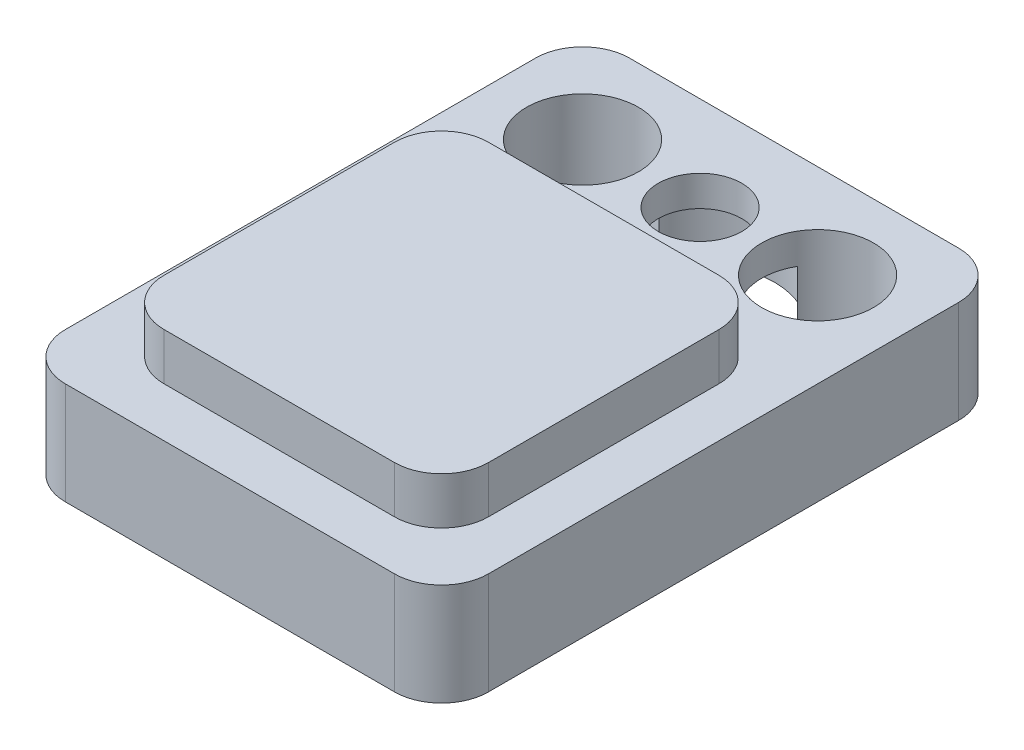
ISO-10303-21;
HEADER;
FILE_DESCRIPTION(('STEP AP214'),'2;1');
FILE_NAME('part.step','',(''),(''),'','','');
FILE_SCHEMA(('AUTOMOTIVE_DESIGN { 1 0 10303 214 1 1 1 1 }'));
ENDSEC;
DATA;
#1=APPLICATION_CONTEXT('core data for automotive mechanical design processes');
#2=APPLICATION_PROTOCOL_DEFINITION('international standard','automotive_design',2000,#1);
#3=PRODUCT_CONTEXT('',#1,'mechanical');
#4=PRODUCT('Part','Part','',(#3));
#5=PRODUCT_RELATED_PRODUCT_CATEGORY('part','',(#4));
#6=PRODUCT_DEFINITION_FORMATION('','',#4);
#7=PRODUCT_DEFINITION_CONTEXT('part definition',#1,'design');
#8=PRODUCT_DEFINITION('design','',#6,#7);
#9=PRODUCT_DEFINITION_SHAPE('','',#8);
#10=(LENGTH_UNIT() NAMED_UNIT(*) SI_UNIT(.MILLI.,.METRE.));
#11=(NAMED_UNIT(*) PLANE_ANGLE_UNIT() SI_UNIT($,.RADIAN.));
#12=(NAMED_UNIT(*) SI_UNIT($,.STERADIAN.) SOLID_ANGLE_UNIT());
#13=UNCERTAINTY_MEASURE_WITH_UNIT(LENGTH_MEASURE(1.E-05),#10,'distance_accuracy_value','');
#14=(GEOMETRIC_REPRESENTATION_CONTEXT(3) GLOBAL_UNCERTAINTY_ASSIGNED_CONTEXT((#13)) GLOBAL_UNIT_ASSIGNED_CONTEXT((#10,
#11,#12)) REPRESENTATION_CONTEXT('',''));
#15=CARTESIAN_POINT('',(0.,0.,0.));
#16=DIRECTION('',(0.,0.,1.));
#17=DIRECTION('',(1.,0.,0.));
#18=AXIS2_PLACEMENT_3D('',#15,#16,#17);
#19=CARTESIAN_POINT('',(0.,0.,-4.));
#20=DIRECTION('',(0.,-1.,0.));
#21=DIRECTION('',(0.,0.,-1.));
#22=AXIS2_PLACEMENT_3D('',#19,#20,#21);
#23=CYLINDRICAL_SURFACE('',#22,1.5875);
#24=CARTESIAN_POINT('',(0.,1.524,-4.));
#25=DIRECTION('',(0.,-1.,0.));
#26=DIRECTION('',(0.,0.,-1.));
#27=AXIS2_PLACEMENT_3D('',#24,#25,#26);
#28=CIRCLE('',#27,1.5875);
#29=CARTESIAN_POINT('',(-1.470513671875,1.524,-4.59811854245518));
#30=VERTEX_POINT('',#29);
#31=CARTESIAN_POINT('',(1.470513671875,1.524,-4.59811854245517));
#32=VERTEX_POINT('',#31);
#33=EDGE_CURVE('E186',#30,#32,#28,.T.);
#34=ORIENTED_EDGE('',*,*,#33,.F.);
#35=DIRECTION('',(0.,-1.,0.));
#36=VECTOR('',#35,1.);
#37=CARTESIAN_POINT('',(-1.470513671875,5.,-4.59811854245518));
#38=LINE('',#37,#36);
#39=CARTESIAN_POINT('',(-1.470513671875,0.,-4.59811854245518));
#40=VERTEX_POINT('',#39);
#41=EDGE_CURVE('E171',#30,#40,#38,.T.);
#42=ORIENTED_EDGE('',*,*,#41,.T.);
#43=CARTESIAN_POINT('',(0.,0.,-4.));
#44=DIRECTION('',(0.,-1.,0.));
#45=DIRECTION('',(0.,0.,-1.));
#46=AXIS2_PLACEMENT_3D('',#43,#44,#45);
#47=CIRCLE('',#46,1.5875);
#48=CARTESIAN_POINT('',(1.470513671875,0.,-4.59811854245517));
#49=VERTEX_POINT('',#48);
#50=EDGE_CURVE('E184',#40,#49,#47,.T.);
#51=ORIENTED_EDGE('',*,*,#50,.T.);
#52=DIRECTION('',(0.,-1.,0.));
#53=VECTOR('',#52,1.);
#54=CARTESIAN_POINT('',(1.470513671875,5.,-4.59811854245517));
#55=LINE('',#54,#53);
#56=EDGE_CURVE('E243',#49,#32,#55,.F.);
#57=ORIENTED_EDGE('',*,*,#56,.T.);
#58=EDGE_LOOP('',(#34,#42,#51,#57));
#59=FACE_BOUND('',#58,.T.);
#60=ADVANCED_FACE('F31',(#59),#23,.F.);
#61=CARTESIAN_POINT('',(-4.5,2.175,-6.));
#62=DIRECTION('',(0.,1.,0.));
#63=DIRECTION('',(0.,0.,1.));
#64=AXIS2_PLACEMENT_3D('',#61,#62,#63);
#65=PLANE('',#64);
#66=CARTESIAN_POINT('',(-2.5,2.175,-4.));
#67=DIRECTION('',(0.,1.,0.));
#68=DIRECTION('',(0.,0.,1.));
#69=AXIS2_PLACEMENT_3D('',#66,#67,#68);
#70=CIRCLE('',#69,1.190625);
#71=CARTESIAN_POINT('',(-2.5,2.175,-2.809375));
#72=VERTEX_POINT('',#71);
#73=EDGE_CURVE('E398',#72,#72,#70,.T.);
#74=ORIENTED_EDGE('',*,*,#73,.F.);
#75=EDGE_LOOP('',(#74));
#76=FACE_BOUND('',#75,.T.);
#77=CARTESIAN_POINT('',(2.5,2.175,-4.));
#78=DIRECTION('',(0.,1.,0.));
#79=DIRECTION('',(0.,0.,1.));
#80=AXIS2_PLACEMENT_3D('',#77,#78,#79);
#81=CIRCLE('',#80,1.190625);
#82=CARTESIAN_POINT('',(2.5,2.175,-2.809375));
#83=VERTEX_POINT('',#82);
#84=EDGE_CURVE('E194',#83,#83,#81,.T.);
#85=ORIENTED_EDGE('',*,*,#84,.F.);
#86=EDGE_LOOP('',(#85));
#87=FACE_BOUND('',#86,.T.);
#88=CARTESIAN_POINT('',(0.,2.175,-4.));
#89=DIRECTION('',(0.,1.,0.));
#90=DIRECTION('',(0.,0.,1.));
#91=AXIS2_PLACEMENT_3D('',#88,#89,#90);
#92=CIRCLE('',#91,0.888999999999999);
#93=CARTESIAN_POINT('',(0.,2.175,-3.111));
#94=VERTEX_POINT('',#93);
#95=EDGE_CURVE('E207',#94,#94,#92,.T.);
#96=ORIENTED_EDGE('',*,*,#95,.F.);
#97=EDGE_LOOP('',(#96));
#98=FACE_BOUND('',#97,.T.);
#99=DIRECTION('',(0.,0.,1.));
#100=VECTOR('',#99,1.);
#101=CARTESIAN_POINT('',(-4.5,2.175,6.));
#102=LINE('',#101,#100);
#103=CARTESIAN_POINT('',(-4.5,2.175,-5.));
#104=VERTEX_POINT('',#103);
#105=CARTESIAN_POINT('',(-4.5,2.175,5.));
#106=VERTEX_POINT('',#105);
#107=EDGE_CURVE('E230',#104,#106,#102,.T.);
#108=ORIENTED_EDGE('',*,*,#107,.T.);
#109=CARTESIAN_POINT('',(-3.5,2.175,5.));
#110=DIRECTION('',(0.,1.,0.));
#111=DIRECTION('',(0.,0.,1.));
#112=AXIS2_PLACEMENT_3D('',#109,#110,#111);
#113=CIRCLE('',#112,1.);
#114=CARTESIAN_POINT('',(-3.5,2.175,6.));
#115=VERTEX_POINT('',#114);
#116=EDGE_CURVE('E284',#106,#115,#113,.T.);
#117=ORIENTED_EDGE('',*,*,#116,.T.);
#118=DIRECTION('',(1.,0.,0.));
#119=VECTOR('',#118,1.);
#120=CARTESIAN_POINT('',(4.5,2.175,6.));
#121=LINE('',#120,#119);
#122=CARTESIAN_POINT('',(3.5,2.175,6.));
#123=VERTEX_POINT('',#122);
#124=EDGE_CURVE('E233',#115,#123,#121,.T.);
#125=ORIENTED_EDGE('',*,*,#124,.T.);
#126=CARTESIAN_POINT('',(3.5,2.175,5.));
#127=DIRECTION('',(0.,1.,0.));
#128=DIRECTION('',(0.,0.,1.));
#129=AXIS2_PLACEMENT_3D('',#126,#127,#128);
#130=CIRCLE('',#129,1.);
#131=CARTESIAN_POINT('',(4.5,2.175,5.));
#132=VERTEX_POINT('',#131);
#133=EDGE_CURVE('E280',#123,#132,#130,.T.);
#134=ORIENTED_EDGE('',*,*,#133,.T.);
#135=DIRECTION('',(0.,0.,-1.));
#136=VECTOR('',#135,1.);
#137=CARTESIAN_POINT('',(4.5,2.175,6.));
#138=LINE('',#137,#136);
#139=CARTESIAN_POINT('',(4.5,2.175,-5.));
#140=VERTEX_POINT('',#139);
#141=EDGE_CURVE('E237',#132,#140,#138,.T.);
#142=ORIENTED_EDGE('',*,*,#141,.T.);
#143=CARTESIAN_POINT('',(3.5,2.175,-5.));
#144=DIRECTION('',(0.,1.,0.));
#145=DIRECTION('',(0.,0.,1.));
#146=AXIS2_PLACEMENT_3D('',#143,#144,#145);
#147=CIRCLE('',#146,1.);
#148=CARTESIAN_POINT('',(3.5,2.175,-6.));
#149=VERTEX_POINT('',#148);
#150=EDGE_CURVE('E278',#140,#149,#147,.T.);
#151=ORIENTED_EDGE('',*,*,#150,.T.);
#152=DIRECTION('',(-1.,0.,0.));
#153=VECTOR('',#152,1.);
#154=CARTESIAN_POINT('',(4.5,2.175,-6.));
#155=LINE('',#154,#153);
#156=CARTESIAN_POINT('',(-3.5,2.175,-6.));
#157=VERTEX_POINT('',#156);
#158=EDGE_CURVE('E240',#149,#157,#155,.T.);
#159=ORIENTED_EDGE('',*,*,#158,.T.);
#160=CARTESIAN_POINT('',(-3.5,2.175,-5.));
#161=DIRECTION('',(0.,1.,0.));
#162=DIRECTION('',(0.,0.,1.));
#163=AXIS2_PLACEMENT_3D('',#160,#161,#162);
#164=CIRCLE('',#163,1.);
#165=EDGE_CURVE('E282',#157,#104,#164,.T.);
#166=ORIENTED_EDGE('',*,*,#165,.T.);
#167=EDGE_LOOP('',(#108,#117,#125,#134,#142,#151,#159,#166));
#168=FACE_BOUND('',#167,.T.);
#169=DIRECTION('',(1.,0.,0.));
#170=VECTOR('',#169,1.);
#171=CARTESIAN_POINT('',(-3.45,2.175,4.95));
#172=LINE('',#171,#170);
#173=CARTESIAN_POINT('',(-2.45,2.175,4.95));
#174=VERTEX_POINT('',#173);
#175=CARTESIAN_POINT('',(2.45,2.175,4.95));
#176=VERTEX_POINT('',#175);
#177=EDGE_CURVE('E223',#174,#176,#172,.T.);
#178=ORIENTED_EDGE('',*,*,#177,.F.);
#179=CARTESIAN_POINT('',(-2.45,2.175,3.95));
#180=DIRECTION('',(0.,1.,0.));
#181=DIRECTION('',(0.,0.,1.));
#182=AXIS2_PLACEMENT_3D('',#179,#180,#181);
#183=CIRCLE('',#182,1.);
#184=CARTESIAN_POINT('',(-3.45,2.175,3.95));
#185=VERTEX_POINT('',#184);
#186=EDGE_CURVE('E322',#174,#185,#183,.F.);
#187=ORIENTED_EDGE('',*,*,#186,.T.);
#188=DIRECTION('',(0.,0.,1.));
#189=VECTOR('',#188,1.);
#190=CARTESIAN_POINT('',(-3.45,2.175,4.95));
#191=LINE('',#190,#189);
#192=CARTESIAN_POINT('',(-3.45,2.175,-0.95));
#193=VERTEX_POINT('',#192);
#194=EDGE_CURVE('E220',#193,#185,#191,.T.);
#195=ORIENTED_EDGE('',*,*,#194,.F.);
#196=CARTESIAN_POINT('',(-2.45,2.175,-0.950000000000001));
#197=DIRECTION('',(0.,1.,0.));
#198=DIRECTION('',(0.,0.,1.));
#199=AXIS2_PLACEMENT_3D('',#196,#197,#198);
#200=CIRCLE('',#199,1.);
#201=CARTESIAN_POINT('',(-2.45,2.175,-1.95));
#202=VERTEX_POINT('',#201);
#203=EDGE_CURVE('E324',#193,#202,#200,.F.);
#204=ORIENTED_EDGE('',*,*,#203,.T.);
#205=DIRECTION('',(-1.,0.,0.));
#206=VECTOR('',#205,1.);
#207=CARTESIAN_POINT('',(-3.45,2.175,-1.95));
#208=LINE('',#207,#206);
#209=CARTESIAN_POINT('',(2.45,2.175,-1.95));
#210=VERTEX_POINT('',#209);
#211=EDGE_CURVE('E212',#210,#202,#208,.T.);
#212=ORIENTED_EDGE('',*,*,#211,.F.);
#213=CARTESIAN_POINT('',(2.45,2.175,-0.950000000000001));
#214=DIRECTION('',(0.,1.,0.));
#215=DIRECTION('',(0.,0.,1.));
#216=AXIS2_PLACEMENT_3D('',#213,#214,#215);
#217=CIRCLE('',#216,1.);
#218=CARTESIAN_POINT('',(3.45,2.175,-0.95));
#219=VERTEX_POINT('',#218);
#220=EDGE_CURVE('E11',#210,#219,#217,.F.);
#221=ORIENTED_EDGE('',*,*,#220,.T.);
#222=DIRECTION('',(0.,0.,-1.));
#223=VECTOR('',#222,1.);
#224=CARTESIAN_POINT('',(3.45,2.175,4.95));
#225=LINE('',#224,#223);
#226=CARTESIAN_POINT('',(3.45,2.175,3.95));
#227=VERTEX_POINT('',#226);
#228=EDGE_CURVE('E226',#227,#219,#225,.T.);
#229=ORIENTED_EDGE('',*,*,#228,.F.);
#230=CARTESIAN_POINT('',(2.45,2.175,3.95));
#231=DIRECTION('',(0.,1.,0.));
#232=DIRECTION('',(0.,0.,1.));
#233=AXIS2_PLACEMENT_3D('',#230,#231,#232);
#234=CIRCLE('',#233,1.);
#235=EDGE_CURVE('E39',#227,#176,#234,.F.);
#236=ORIENTED_EDGE('',*,*,#235,.T.);
#237=EDGE_LOOP('',(#178,#187,#195,#204,#212,#221,#229,#236));
#238=FACE_BOUND('',#237,.T.);
#239=ADVANCED_FACE('F328',(#76,#87,#98,#168,#238),#65,.T.);
#240=CARTESIAN_POINT('',(-4.5,2.175,6.));
#241=DIRECTION('',(1.,0.,0.));
#242=DIRECTION('',(0.,0.,-1.));
#243=AXIS2_PLACEMENT_3D('',#240,#241,#242);
#244=PLANE('',#243);
#245=DIRECTION('',(0.,0.,1.));
#246=VECTOR('',#245,1.);
#247=CARTESIAN_POINT('',(-4.5,0.,6.));
#248=LINE('',#247,#246);
#249=CARTESIAN_POINT('',(-4.5,0.,-5.));
#250=VERTEX_POINT('',#249);
#251=CARTESIAN_POINT('',(-4.5,0.,5.));
#252=VERTEX_POINT('',#251);
#253=EDGE_CURVE('E219',#250,#252,#248,.T.);
#254=ORIENTED_EDGE('',*,*,#253,.T.);
#255=DIRECTION('',(0.,-1.,0.));
#256=VECTOR('',#255,1.);
#257=CARTESIAN_POINT('',(-4.5,2.175,5.));
#258=LINE('',#257,#256);
#259=EDGE_CURVE('E276',#252,#106,#258,.F.);
#260=ORIENTED_EDGE('',*,*,#259,.T.);
#261=ORIENTED_EDGE('',*,*,#107,.F.);
#262=DIRECTION('',(0.,-1.,0.));
#263=VECTOR('',#262,1.);
#264=CARTESIAN_POINT('',(-4.5,2.175,-5.));
#265=LINE('',#264,#263);
#266=EDGE_CURVE('E273',#104,#250,#265,.T.);
#267=ORIENTED_EDGE('',*,*,#266,.T.);
#268=EDGE_LOOP('',(#254,#260,#261,#267));
#269=FACE_BOUND('',#268,.T.);
#270=ADVANCED_FACE('F377',(#269),#244,.F.);
#271=CARTESIAN_POINT('',(4.5,2.175,6.));
#272=DIRECTION('',(0.,0.,-1.));
#273=DIRECTION('',(-1.,0.,0.));
#274=AXIS2_PLACEMENT_3D('',#271,#272,#273);
#275=PLANE('',#274);
#276=ORIENTED_EDGE('',*,*,#124,.F.);
#277=DIRECTION('',(0.,-1.,0.));
#278=VECTOR('',#277,1.);
#279=CARTESIAN_POINT('',(-3.5,2.175,6.));
#280=LINE('',#279,#278);
#281=CARTESIAN_POINT('',(-3.5,0.,6.));
#282=VERTEX_POINT('',#281);
#283=EDGE_CURVE('E262',#115,#282,#280,.T.);
#284=ORIENTED_EDGE('',*,*,#283,.T.);
#285=DIRECTION('',(1.,0.,0.));
#286=VECTOR('',#285,1.);
#287=CARTESIAN_POINT('',(4.5,0.,6.));
#288=LINE('',#287,#286);
#289=CARTESIAN_POINT('',(3.5,0.,6.));
#290=VERTEX_POINT('',#289);
#291=EDGE_CURVE('E246',#282,#290,#288,.T.);
#292=ORIENTED_EDGE('',*,*,#291,.T.);
#293=DIRECTION('',(0.,-1.,0.));
#294=VECTOR('',#293,1.);
#295=CARTESIAN_POINT('',(3.5,2.175,6.));
#296=LINE('',#295,#294);
#297=EDGE_CURVE('E187',#290,#123,#296,.F.);
#298=ORIENTED_EDGE('',*,*,#297,.T.);
#299=EDGE_LOOP('',(#276,#284,#292,#298));
#300=FACE_BOUND('',#299,.T.);
#301=ADVANCED_FACE('F420',(#300),#275,.F.);
#302=CARTESIAN_POINT('',(4.5,2.175,6.));
#303=DIRECTION('',(-1.,0.,0.));
#304=DIRECTION('',(0.,0.,1.));
#305=AXIS2_PLACEMENT_3D('',#302,#303,#304);
#306=PLANE('',#305);
#307=ORIENTED_EDGE('',*,*,#141,.F.);
#308=DIRECTION('',(0.,-1.,0.));
#309=VECTOR('',#308,1.);
#310=CARTESIAN_POINT('',(4.5,2.175,5.));
#311=LINE('',#310,#309);
#312=CARTESIAN_POINT('',(4.5,0.,5.));
#313=VERTEX_POINT('',#312);
#314=EDGE_CURVE('E314',#132,#313,#311,.T.);
#315=ORIENTED_EDGE('',*,*,#314,.T.);
#316=DIRECTION('',(0.,0.,-1.));
#317=VECTOR('',#316,1.);
#318=CARTESIAN_POINT('',(4.5,0.,6.));
#319=LINE('',#318,#317);
#320=CARTESIAN_POINT('',(4.5,0.,-5.));
#321=VERTEX_POINT('',#320);
#322=EDGE_CURVE('E249',#313,#321,#319,.T.);
#323=ORIENTED_EDGE('',*,*,#322,.T.);
#324=DIRECTION('',(0.,-1.,0.));
#325=VECTOR('',#324,1.);
#326=CARTESIAN_POINT('',(4.5,2.175,-5.));
#327=LINE('',#326,#325);
#328=EDGE_CURVE('E312',#321,#140,#327,.F.);
#329=ORIENTED_EDGE('',*,*,#328,.T.);
#330=EDGE_LOOP('',(#307,#315,#323,#329));
#331=FACE_BOUND('',#330,.T.);
#332=ADVANCED_FACE('F430',(#331),#306,.F.);
#333=CARTESIAN_POINT('',(4.5,2.175,-6.));
#334=DIRECTION('',(0.,0.,1.));
#335=DIRECTION('',(1.,0.,0.));
#336=AXIS2_PLACEMENT_3D('',#333,#334,#335);
#337=PLANE('',#336);
#338=DIRECTION('',(-1.,0.,0.));
#339=VECTOR('',#338,1.);
#340=CARTESIAN_POINT('',(4.5,0.,-6.));
#341=LINE('',#340,#339);
#342=CARTESIAN_POINT('',(3.5,0.,-6.));
#343=VERTEX_POINT('',#342);
#344=CARTESIAN_POINT('',(-3.5,0.,-6.));
#345=VERTEX_POINT('',#344);
#346=EDGE_CURVE('E234',#343,#345,#341,.T.);
#347=ORIENTED_EDGE('',*,*,#346,.T.);
#348=DIRECTION('',(0.,-1.,0.));
#349=VECTOR('',#348,1.);
#350=CARTESIAN_POINT('',(-3.5,2.175,-6.));
#351=LINE('',#350,#349);
#352=EDGE_CURVE('E310',#345,#157,#351,.F.);
#353=ORIENTED_EDGE('',*,*,#352,.T.);
#354=ORIENTED_EDGE('',*,*,#158,.F.);
#355=DIRECTION('',(0.,-1.,0.));
#356=VECTOR('',#355,1.);
#357=CARTESIAN_POINT('',(3.5,2.175,-6.));
#358=LINE('',#357,#356);
#359=EDGE_CURVE('E307',#149,#343,#358,.T.);
#360=ORIENTED_EDGE('',*,*,#359,.T.);
#361=EDGE_LOOP('',(#347,#353,#354,#360));
#362=FACE_BOUND('',#361,.T.);
#363=ADVANCED_FACE('F438',(#362),#337,.F.);
#364=CARTESIAN_POINT('',(-4.5,0.,-6.));
#365=DIRECTION('',(0.,1.,0.));
#366=DIRECTION('',(0.,0.,1.));
#367=AXIS2_PLACEMENT_3D('',#364,#365,#366);
#368=PLANE('',#367);
#369=ORIENTED_EDGE('',*,*,#50,.F.);
#370=CARTESIAN_POINT('',(-2.5,0.,-4.));
#371=DIRECTION('',(0.,-1.,0.));
#372=DIRECTION('',(0.,0.,-1.));
#373=AXIS2_PLACEMENT_3D('',#370,#371,#372);
#374=CIRCLE('',#373,1.190625);
#375=CARTESIAN_POINT('',(-1.470513671875,0.,-3.40188145754483));
#376=VERTEX_POINT('',#375);
#377=EDGE_CURVE('E168',#376,#40,#374,.T.);
#378=ORIENTED_EDGE('',*,*,#377,.F.);
#379=CARTESIAN_POINT('',(1.470513671875,0.,-3.40188145754483));
#380=VERTEX_POINT('',#379);
#381=EDGE_CURVE('E193',#380,#376,#47,.T.);
#382=ORIENTED_EDGE('',*,*,#381,.F.);
#383=CARTESIAN_POINT('',(2.5,0.,-4.));
#384=DIRECTION('',(0.,-1.,0.));
#385=DIRECTION('',(0.,0.,-1.));
#386=AXIS2_PLACEMENT_3D('',#383,#384,#385);
#387=CIRCLE('',#386,1.190625);
#388=EDGE_CURVE('E192',#49,#380,#387,.T.);
#389=ORIENTED_EDGE('',*,*,#388,.F.);
#390=EDGE_LOOP('',(#369,#378,#382,#389));
#391=FACE_BOUND('',#390,.T.);
#392=ORIENTED_EDGE('',*,*,#291,.F.);
#393=CARTESIAN_POINT('',(-3.5,0.,5.));
#394=DIRECTION('',(0.,1.,0.));
#395=DIRECTION('',(0.,0.,1.));
#396=AXIS2_PLACEMENT_3D('',#393,#394,#395);
#397=CIRCLE('',#396,1.);
#398=EDGE_CURVE('E271',#282,#252,#397,.F.);
#399=ORIENTED_EDGE('',*,*,#398,.T.);
#400=ORIENTED_EDGE('',*,*,#253,.F.);
#401=CARTESIAN_POINT('',(-3.5,0.,-5.));
#402=DIRECTION('',(0.,1.,0.));
#403=DIRECTION('',(0.,0.,1.));
#404=AXIS2_PLACEMENT_3D('',#401,#402,#403);
#405=CIRCLE('',#404,1.);
#406=EDGE_CURVE('E269',#250,#345,#405,.F.);
#407=ORIENTED_EDGE('',*,*,#406,.T.);
#408=ORIENTED_EDGE('',*,*,#346,.F.);
#409=CARTESIAN_POINT('',(3.5,0.,-5.));
#410=DIRECTION('',(0.,1.,0.));
#411=DIRECTION('',(0.,0.,1.));
#412=AXIS2_PLACEMENT_3D('',#409,#410,#411);
#413=CIRCLE('',#412,1.);
#414=EDGE_CURVE('E265',#343,#321,#413,.F.);
#415=ORIENTED_EDGE('',*,*,#414,.T.);
#416=ORIENTED_EDGE('',*,*,#322,.F.);
#417=CARTESIAN_POINT('',(3.5,0.,5.));
#418=DIRECTION('',(0.,1.,0.));
#419=DIRECTION('',(0.,0.,1.));
#420=AXIS2_PLACEMENT_3D('',#417,#418,#419);
#421=CIRCLE('',#420,1.);
#422=EDGE_CURVE('E267',#313,#290,#421,.F.);
#423=ORIENTED_EDGE('',*,*,#422,.T.);
#424=EDGE_LOOP('',(#392,#399,#400,#407,#408,#415,#416,#423));
#425=FACE_BOUND('',#424,.T.);
#426=ADVANCED_FACE('F190',(#391,#425),#368,.F.);
#427=CARTESIAN_POINT('',(-3.45,3.175,4.95));
#428=DIRECTION('',(1.,0.,0.));
#429=DIRECTION('',(0.,0.,-1.));
#430=AXIS2_PLACEMENT_3D('',#427,#428,#429);
#431=PLANE('',#430);
#432=ORIENTED_EDGE('',*,*,#194,.T.);
#433=DIRECTION('',(0.,-1.,0.));
#434=VECTOR('',#433,1.);
#435=CARTESIAN_POINT('',(-3.45,3.175,3.95));
#436=LINE('',#435,#434);
#437=CARTESIAN_POINT('',(-3.45,3.175,3.95));
#438=VERTEX_POINT('',#437);
#439=EDGE_CURVE('E294',#185,#438,#436,.F.);
#440=ORIENTED_EDGE('',*,*,#439,.T.);
#441=DIRECTION('',(0.,0.,1.));
#442=VECTOR('',#441,1.);
#443=CARTESIAN_POINT('',(-3.45,3.175,4.95));
#444=LINE('',#443,#442);
#445=CARTESIAN_POINT('',(-3.45,3.175,-0.95));
#446=VERTEX_POINT('',#445);
#447=EDGE_CURVE('E208',#446,#438,#444,.T.);
#448=ORIENTED_EDGE('',*,*,#447,.F.);
#449=DIRECTION('',(0.,-1.,0.));
#450=VECTOR('',#449,1.);
#451=CARTESIAN_POINT('',(-3.45,3.175,-0.950000000000001));
#452=LINE('',#451,#450);
#453=EDGE_CURVE('E291',#446,#193,#452,.T.);
#454=ORIENTED_EDGE('',*,*,#453,.T.);
#455=EDGE_LOOP('',(#432,#440,#448,#454));
#456=FACE_BOUND('',#455,.T.);
#457=ADVANCED_FACE('F355',(#456),#431,.F.);
#458=CARTESIAN_POINT('',(-3.45,3.175,4.95));
#459=DIRECTION('',(0.,0.,-1.));
#460=DIRECTION('',(-1.,0.,0.));
#461=AXIS2_PLACEMENT_3D('',#458,#459,#460);
#462=PLANE('',#461);
#463=DIRECTION('',(1.,0.,0.));
#464=VECTOR('',#463,1.);
#465=CARTESIAN_POINT('',(-3.45,3.175,4.95));
#466=LINE('',#465,#464);
#467=CARTESIAN_POINT('',(-2.45,3.175,4.95));
#468=VERTEX_POINT('',#467);
#469=CARTESIAN_POINT('',(2.45,3.175,4.95));
#470=VERTEX_POINT('',#469);
#471=EDGE_CURVE('E211',#468,#470,#466,.T.);
#472=ORIENTED_EDGE('',*,*,#471,.F.);
#473=DIRECTION('',(0.,-1.,0.));
#474=VECTOR('',#473,1.);
#475=CARTESIAN_POINT('',(-2.45,3.175,4.95));
#476=LINE('',#475,#474);
#477=EDGE_CURVE('E288',#468,#174,#476,.T.);
#478=ORIENTED_EDGE('',*,*,#477,.T.);
#479=ORIENTED_EDGE('',*,*,#177,.T.);
#480=DIRECTION('',(0.,-1.,0.));
#481=VECTOR('',#480,1.);
#482=CARTESIAN_POINT('',(2.45,3.175,4.95));
#483=LINE('',#482,#481);
#484=EDGE_CURVE('E286',#176,#470,#483,.F.);
#485=ORIENTED_EDGE('',*,*,#484,.T.);
#486=EDGE_LOOP('',(#472,#478,#479,#485));
#487=FACE_BOUND('',#486,.T.);
#488=ADVANCED_FACE('F334',(#487),#462,.F.);
#489=CARTESIAN_POINT('',(3.45,3.175,4.95));
#490=DIRECTION('',(-1.,0.,0.));
#491=DIRECTION('',(0.,0.,1.));
#492=AXIS2_PLACEMENT_3D('',#489,#490,#491);
#493=PLANE('',#492);
#494=DIRECTION('',(0.,0.,-1.));
#495=VECTOR('',#494,1.);
#496=CARTESIAN_POINT('',(3.45,3.175,4.95));
#497=LINE('',#496,#495);
#498=CARTESIAN_POINT('',(3.45,3.175,3.95));
#499=VERTEX_POINT('',#498);
#500=CARTESIAN_POINT('',(3.45,3.175,-0.95));
#501=VERTEX_POINT('',#500);
#502=EDGE_CURVE('E215',#499,#501,#497,.T.);
#503=ORIENTED_EDGE('',*,*,#502,.F.);
#504=DIRECTION('',(0.,-1.,0.));
#505=VECTOR('',#504,1.);
#506=CARTESIAN_POINT('',(3.45,3.175,3.95));
#507=LINE('',#506,#505);
#508=EDGE_CURVE('E319',#499,#227,#507,.T.);
#509=ORIENTED_EDGE('',*,*,#508,.T.);
#510=ORIENTED_EDGE('',*,*,#228,.T.);
#511=DIRECTION('',(0.,-1.,0.));
#512=VECTOR('',#511,1.);
#513=CARTESIAN_POINT('',(3.45,3.175,-0.950000000000001));
#514=LINE('',#513,#512);
#515=EDGE_CURVE('E317',#219,#501,#514,.F.);
#516=ORIENTED_EDGE('',*,*,#515,.T.);
#517=EDGE_LOOP('',(#503,#509,#510,#516));
#518=FACE_BOUND('',#517,.T.);
#519=ADVANCED_FACE('F341',(#518),#493,.F.);
#520=CARTESIAN_POINT('',(-3.45,3.175,-1.95));
#521=DIRECTION('',(0.,0.,1.));
#522=DIRECTION('',(1.,0.,0.));
#523=AXIS2_PLACEMENT_3D('',#520,#521,#522);
#524=PLANE('',#523);
#525=ORIENTED_EDGE('',*,*,#211,.T.);
#526=DIRECTION('',(0.,-1.,0.));
#527=VECTOR('',#526,1.);
#528=CARTESIAN_POINT('',(-2.45,3.175,-1.95));
#529=LINE('',#528,#527);
#530=CARTESIAN_POINT('',(-2.45,3.175,-1.95));
#531=VERTEX_POINT('',#530);
#532=EDGE_CURVE('E46',#202,#531,#529,.F.);
#533=ORIENTED_EDGE('',*,*,#532,.T.);
#534=DIRECTION('',(-1.,0.,0.));
#535=VECTOR('',#534,1.);
#536=CARTESIAN_POINT('',(-3.45,3.175,-1.95));
#537=LINE('',#536,#535);
#538=CARTESIAN_POINT('',(2.45,3.175,-1.95));
#539=VERTEX_POINT('',#538);
#540=EDGE_CURVE('E217',#539,#531,#537,.T.);
#541=ORIENTED_EDGE('',*,*,#540,.F.);
#542=DIRECTION('',(0.,-1.,0.));
#543=VECTOR('',#542,1.);
#544=CARTESIAN_POINT('',(2.45,3.175,-1.95));
#545=LINE('',#544,#543);
#546=EDGE_CURVE('E303',#539,#210,#545,.T.);
#547=ORIENTED_EDGE('',*,*,#546,.T.);
#548=EDGE_LOOP('',(#525,#533,#541,#547));
#549=FACE_BOUND('',#548,.T.);
#550=ADVANCED_FACE('F347',(#549),#524,.F.);
#551=CARTESIAN_POINT('',(-3.45,3.175,-1.95));
#552=DIRECTION('',(0.,-1.,0.));
#553=DIRECTION('',(0.,0.,-1.));
#554=AXIS2_PLACEMENT_3D('',#551,#552,#553);
#555=PLANE('',#554);
#556=ORIENTED_EDGE('',*,*,#447,.T.);
#557=CARTESIAN_POINT('',(-2.45,3.175,3.95));
#558=DIRECTION('',(0.,-1.,0.));
#559=DIRECTION('',(0.,0.,-1.));
#560=AXIS2_PLACEMENT_3D('',#557,#558,#559);
#561=CIRCLE('',#560,1.);
#562=EDGE_CURVE('E301',#438,#468,#561,.F.);
#563=ORIENTED_EDGE('',*,*,#562,.T.);
#564=ORIENTED_EDGE('',*,*,#471,.T.);
#565=CARTESIAN_POINT('',(2.45,3.175,3.95));
#566=DIRECTION('',(0.,-1.,0.));
#567=DIRECTION('',(0.,0.,-1.));
#568=AXIS2_PLACEMENT_3D('',#565,#566,#567);
#569=CIRCLE('',#568,1.);
#570=EDGE_CURVE('E297',#470,#499,#569,.F.);
#571=ORIENTED_EDGE('',*,*,#570,.T.);
#572=ORIENTED_EDGE('',*,*,#502,.T.);
#573=CARTESIAN_POINT('',(2.45,3.175,-0.950000000000001));
#574=DIRECTION('',(0.,-1.,0.));
#575=DIRECTION('',(0.,0.,-1.));
#576=AXIS2_PLACEMENT_3D('',#573,#574,#575);
#577=CIRCLE('',#576,1.);
#578=EDGE_CURVE('E53',#501,#539,#577,.F.);
#579=ORIENTED_EDGE('',*,*,#578,.T.);
#580=ORIENTED_EDGE('',*,*,#540,.T.);
#581=CARTESIAN_POINT('',(-2.45,3.175,-0.950000000000001));
#582=DIRECTION('',(0.,-1.,0.));
#583=DIRECTION('',(0.,0.,-1.));
#584=AXIS2_PLACEMENT_3D('',#581,#582,#583);
#585=CIRCLE('',#584,1.);
#586=EDGE_CURVE('E299',#531,#446,#585,.F.);
#587=ORIENTED_EDGE('',*,*,#586,.T.);
#588=EDGE_LOOP('',(#556,#563,#564,#571,#572,#579,#580,#587));
#589=FACE_BOUND('',#588,.T.);
#590=ADVANCED_FACE('F339',(#589),#555,.F.);
#591=CARTESIAN_POINT('',(0.,0.,-4.));
#592=DIRECTION('',(0.,-1.,0.));
#593=DIRECTION('',(0.,0.,-1.));
#594=AXIS2_PLACEMENT_3D('',#591,#592,#593);
#595=CYLINDRICAL_SURFACE('',#594,0.888999999999999);
#596=ORIENTED_EDGE('',*,*,#95,.T.);
#597=EDGE_LOOP('',(#596));
#598=FACE_BOUND('',#597,.T.);
#599=CARTESIAN_POINT('',(0.,1.524,-4.));
#600=DIRECTION('',(0.,-1.,0.));
#601=DIRECTION('',(0.,0.,-1.));
#602=AXIS2_PLACEMENT_3D('',#599,#600,#601);
#603=CIRCLE('',#602,0.889);
#604=CARTESIAN_POINT('',(0.,1.524,-4.889));
#605=VERTEX_POINT('',#604);
#606=EDGE_CURVE('E204',#605,#605,#603,.T.);
#607=ORIENTED_EDGE('',*,*,#606,.T.);
#608=EDGE_LOOP('',(#607));
#609=FACE_BOUND('',#608,.T.);
#610=ADVANCED_FACE('F391',(#598,#609),#595,.F.);
#611=CARTESIAN_POINT('',(0.888999999999997,1.524,-4.));
#612=DIRECTION('',(0.,1.,0.));
#613=DIRECTION('',(0.,0.,1.));
#614=AXIS2_PLACEMENT_3D('',#611,#612,#613);
#615=PLANE('',#614);
#616=ORIENTED_EDGE('',*,*,#606,.F.);
#617=EDGE_LOOP('',(#616));
#618=FACE_BOUND('',#617,.T.);
#619=CARTESIAN_POINT('',(1.470513671875,1.524,-3.40188145754483));
#620=VERTEX_POINT('',#619);
#621=CARTESIAN_POINT('',(-1.470513671875,1.524,-3.40188145754483));
#622=VERTEX_POINT('',#621);
#623=EDGE_CURVE('E201',#620,#622,#28,.T.);
#624=ORIENTED_EDGE('',*,*,#623,.T.);
#625=CARTESIAN_POINT('',(-2.5,1.524,-4.));
#626=DIRECTION('',(0.,1.,0.));
#627=DIRECTION('',(0.,0.,1.));
#628=AXIS2_PLACEMENT_3D('',#625,#626,#627);
#629=CIRCLE('',#628,1.190625);
#630=EDGE_CURVE('E179',#622,#30,#629,.T.);
#631=ORIENTED_EDGE('',*,*,#630,.T.);
#632=ORIENTED_EDGE('',*,*,#33,.T.);
#633=CARTESIAN_POINT('',(2.5,1.524,-4.));
#634=DIRECTION('',(0.,1.,0.));
#635=DIRECTION('',(0.,0.,1.));
#636=AXIS2_PLACEMENT_3D('',#633,#634,#635);
#637=CIRCLE('',#636,1.190625);
#638=EDGE_CURVE('E197',#32,#620,#637,.T.);
#639=ORIENTED_EDGE('',*,*,#638,.T.);
#640=EDGE_LOOP('',(#624,#631,#632,#639));
#641=FACE_BOUND('',#640,.T.);
#642=ADVANCED_FACE('F384',(#618,#641),#615,.F.);
#643=ORIENTED_EDGE('',*,*,#381,.T.);
#644=DIRECTION('',(0.,-1.,0.));
#645=VECTOR('',#644,1.);
#646=CARTESIAN_POINT('',(-1.470513671875,5.,-3.40188145754483));
#647=LINE('',#646,#645);
#648=EDGE_CURVE('E174',#376,#622,#647,.F.);
#649=ORIENTED_EDGE('',*,*,#648,.T.);
#650=ORIENTED_EDGE('',*,*,#623,.F.);
#651=DIRECTION('',(0.,-1.,0.));
#652=VECTOR('',#651,1.);
#653=CARTESIAN_POINT('',(1.470513671875,5.,-3.40188145754483));
#654=LINE('',#653,#652);
#655=EDGE_CURVE('E257',#620,#380,#654,.T.);
#656=ORIENTED_EDGE('',*,*,#655,.T.);
#657=EDGE_LOOP('',(#643,#649,#650,#656));
#658=FACE_BOUND('',#657,.T.);
#659=ADVANCED_FACE('F373',(#658),#23,.F.);
#660=CARTESIAN_POINT('',(2.5,0.,-4.));
#661=DIRECTION('',(0.,-1.,0.));
#662=DIRECTION('',(0.,0.,-1.));
#663=AXIS2_PLACEMENT_3D('',#660,#661,#662);
#664=CYLINDRICAL_SURFACE('',#663,1.190625);
#665=ORIENTED_EDGE('',*,*,#84,.T.);
#666=EDGE_LOOP('',(#665));
#667=FACE_BOUND('',#666,.T.);
#668=ORIENTED_EDGE('',*,*,#638,.F.);
#669=ORIENTED_EDGE('',*,*,#56,.F.);
#670=ORIENTED_EDGE('',*,*,#388,.T.);
#671=ORIENTED_EDGE('',*,*,#655,.F.);
#672=EDGE_LOOP('',(#668,#669,#670,#671));
#673=FACE_BOUND('',#672,.T.);
#674=ADVANCED_FACE('F383',(#667,#673),#664,.F.);
#675=CARTESIAN_POINT('',(-2.5,0.,-4.));
#676=DIRECTION('',(0.,-1.,0.));
#677=DIRECTION('',(0.,0.,-1.));
#678=AXIS2_PLACEMENT_3D('',#675,#676,#677);
#679=CYLINDRICAL_SURFACE('',#678,1.190625);
#680=ORIENTED_EDGE('',*,*,#73,.T.);
#681=EDGE_LOOP('',(#680));
#682=FACE_BOUND('',#681,.T.);
#683=ORIENTED_EDGE('',*,*,#630,.F.);
#684=ORIENTED_EDGE('',*,*,#648,.F.);
#685=ORIENTED_EDGE('',*,*,#377,.T.);
#686=ORIENTED_EDGE('',*,*,#41,.F.);
#687=EDGE_LOOP('',(#683,#684,#685,#686));
#688=FACE_BOUND('',#687,.T.);
#689=ADVANCED_FACE('F170',(#682,#688),#679,.F.);
#690=CARTESIAN_POINT('',(-3.5,2.175,5.));
#691=DIRECTION('',(0.,-1.,0.));
#692=DIRECTION('',(0.,0.,-1.));
#693=AXIS2_PLACEMENT_3D('',#690,#691,#692);
#694=CYLINDRICAL_SURFACE('',#693,1.);
#695=ORIENTED_EDGE('',*,*,#116,.F.);
#696=ORIENTED_EDGE('',*,*,#259,.F.);
#697=ORIENTED_EDGE('',*,*,#398,.F.);
#698=ORIENTED_EDGE('',*,*,#283,.F.);
#699=EDGE_LOOP('',(#695,#696,#697,#698));
#700=FACE_BOUND('',#699,.T.);
#701=ADVANCED_FACE('F361',(#700),#694,.T.);
#702=CARTESIAN_POINT('',(-2.45,3.175,3.95));
#703=DIRECTION('',(0.,-1.,0.));
#704=DIRECTION('',(0.,0.,-1.));
#705=AXIS2_PLACEMENT_3D('',#702,#703,#704);
#706=CYLINDRICAL_SURFACE('',#705,1.);
#707=ORIENTED_EDGE('',*,*,#562,.F.);
#708=ORIENTED_EDGE('',*,*,#439,.F.);
#709=ORIENTED_EDGE('',*,*,#186,.F.);
#710=ORIENTED_EDGE('',*,*,#477,.F.);
#711=EDGE_LOOP('',(#707,#708,#709,#710));
#712=FACE_BOUND('',#711,.T.);
#713=ADVANCED_FACE('F359',(#712),#706,.T.);
#714=CARTESIAN_POINT('',(-2.45,3.175,-0.950000000000001));
#715=DIRECTION('',(0.,-1.,0.));
#716=DIRECTION('',(0.,0.,-1.));
#717=AXIS2_PLACEMENT_3D('',#714,#715,#716);
#718=CYLINDRICAL_SURFACE('',#717,1.);
#719=ORIENTED_EDGE('',*,*,#586,.F.);
#720=ORIENTED_EDGE('',*,*,#532,.F.);
#721=ORIENTED_EDGE('',*,*,#203,.F.);
#722=ORIENTED_EDGE('',*,*,#453,.F.);
#723=EDGE_LOOP('',(#719,#720,#721,#722));
#724=FACE_BOUND('',#723,.T.);
#725=ADVANCED_FACE('F352',(#724),#718,.T.);
#726=CARTESIAN_POINT('',(-3.5,2.175,-5.));
#727=DIRECTION('',(0.,-1.,0.));
#728=DIRECTION('',(0.,0.,-1.));
#729=AXIS2_PLACEMENT_3D('',#726,#727,#728);
#730=CYLINDRICAL_SURFACE('',#729,1.);
#731=ORIENTED_EDGE('',*,*,#165,.F.);
#732=ORIENTED_EDGE('',*,*,#352,.F.);
#733=ORIENTED_EDGE('',*,*,#406,.F.);
#734=ORIENTED_EDGE('',*,*,#266,.F.);
#735=EDGE_LOOP('',(#731,#732,#733,#734));
#736=FACE_BOUND('',#735,.T.);
#737=ADVANCED_FACE('F367',(#736),#730,.T.);
#738=CARTESIAN_POINT('',(3.5,2.175,5.));
#739=DIRECTION('',(0.,-1.,0.));
#740=DIRECTION('',(0.,0.,-1.));
#741=AXIS2_PLACEMENT_3D('',#738,#739,#740);
#742=CYLINDRICAL_SURFACE('',#741,1.);
#743=ORIENTED_EDGE('',*,*,#133,.F.);
#744=ORIENTED_EDGE('',*,*,#297,.F.);
#745=ORIENTED_EDGE('',*,*,#422,.F.);
#746=ORIENTED_EDGE('',*,*,#314,.F.);
#747=EDGE_LOOP('',(#743,#744,#745,#746));
#748=FACE_BOUND('',#747,.T.);
#749=ADVANCED_FACE('F427',(#748),#742,.T.);
#750=CARTESIAN_POINT('',(2.45,3.175,3.95));
#751=DIRECTION('',(0.,-1.,0.));
#752=DIRECTION('',(0.,0.,-1.));
#753=AXIS2_PLACEMENT_3D('',#750,#751,#752);
#754=CYLINDRICAL_SURFACE('',#753,1.);
#755=ORIENTED_EDGE('',*,*,#570,.F.);
#756=ORIENTED_EDGE('',*,*,#484,.F.);
#757=ORIENTED_EDGE('',*,*,#235,.F.);
#758=ORIENTED_EDGE('',*,*,#508,.F.);
#759=EDGE_LOOP('',(#755,#756,#757,#758));
#760=FACE_BOUND('',#759,.T.);
#761=ADVANCED_FACE('F337',(#760),#754,.T.);
#762=CARTESIAN_POINT('',(2.45,3.175,-0.950000000000001));
#763=DIRECTION('',(0.,-1.,0.));
#764=DIRECTION('',(0.,0.,-1.));
#765=AXIS2_PLACEMENT_3D('',#762,#763,#764);
#766=CYLINDRICAL_SURFACE('',#765,1.);
#767=ORIENTED_EDGE('',*,*,#578,.F.);
#768=ORIENTED_EDGE('',*,*,#515,.F.);
#769=ORIENTED_EDGE('',*,*,#220,.F.);
#770=ORIENTED_EDGE('',*,*,#546,.F.);
#771=EDGE_LOOP('',(#767,#768,#769,#770));
#772=FACE_BOUND('',#771,.T.);
#773=ADVANCED_FACE('F344',(#772),#766,.T.);
#774=CARTESIAN_POINT('',(3.5,2.175,-5.));
#775=DIRECTION('',(0.,-1.,0.));
#776=DIRECTION('',(0.,0.,-1.));
#777=AXIS2_PLACEMENT_3D('',#774,#775,#776);
#778=CYLINDRICAL_SURFACE('',#777,1.);
#779=ORIENTED_EDGE('',*,*,#150,.F.);
#780=ORIENTED_EDGE('',*,*,#328,.F.);
#781=ORIENTED_EDGE('',*,*,#414,.F.);
#782=ORIENTED_EDGE('',*,*,#359,.F.);
#783=EDGE_LOOP('',(#779,#780,#781,#782));
#784=FACE_BOUND('',#783,.T.);
#785=ADVANCED_FACE('F33',(#784),#778,.T.);
#786=CLOSED_SHELL('',(#60,#239,#270,#301,#332,#363,#426,#457,#488,#519,#550,#590,#610,#642,#659,
#674,#689,#701,#713,#725,#737,#749,#761,#773,#785));
#787=MANIFOLD_SOLID_BREP('B2',#786);
#788=ADVANCED_BREP_SHAPE_REPRESENTATION('',(#18,#787),#14);
#789=SHAPE_DEFINITION_REPRESENTATION(#9,#788);
ENDSEC;
END-ISO-10303-21;
